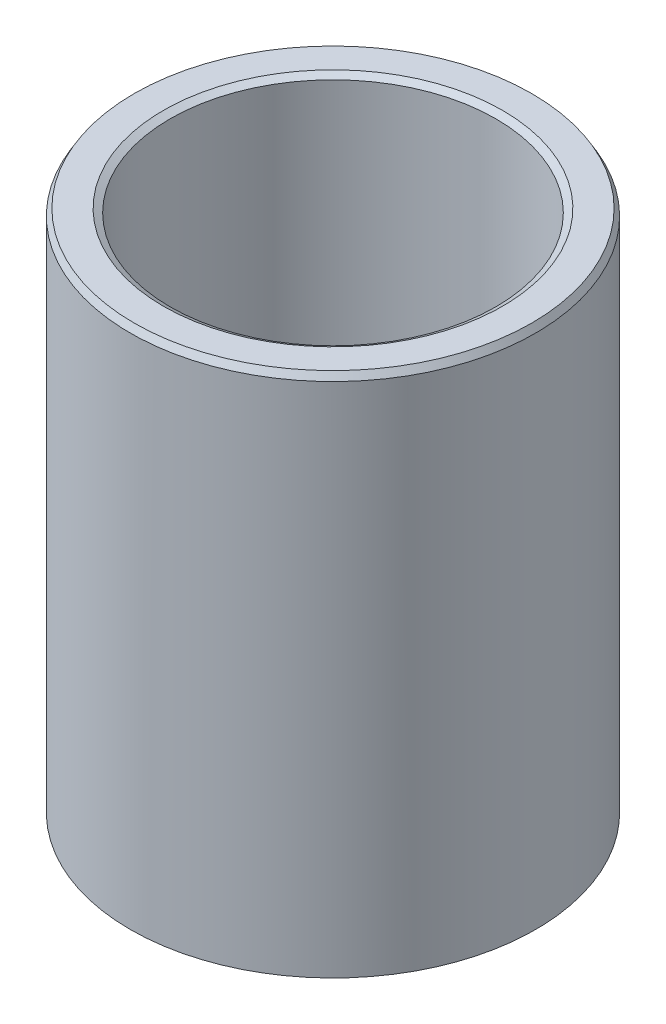
ISO-10303-21;
HEADER;
FILE_DESCRIPTION(('STEP AP214'),'2;1');
FILE_NAME('part.step','',(''),(''),'','','');
FILE_SCHEMA(('AUTOMOTIVE_DESIGN { 1 0 10303 214 1 1 1 1 }'));
ENDSEC;
DATA;
#1=APPLICATION_CONTEXT('core data for automotive mechanical design processes');
#2=APPLICATION_PROTOCOL_DEFINITION('international standard','automotive_design',2000,#1);
#3=PRODUCT_CONTEXT('',#1,'mechanical');
#4=PRODUCT('Part','Part','',(#3));
#5=PRODUCT_RELATED_PRODUCT_CATEGORY('part','',(#4));
#6=PRODUCT_DEFINITION_FORMATION('','',#4);
#7=PRODUCT_DEFINITION_CONTEXT('part definition',#1,'design');
#8=PRODUCT_DEFINITION('design','',#6,#7);
#9=PRODUCT_DEFINITION_SHAPE('','',#8);
#10=(LENGTH_UNIT() NAMED_UNIT(*) SI_UNIT(.MILLI.,.METRE.));
#11=(NAMED_UNIT(*) PLANE_ANGLE_UNIT() SI_UNIT($,.RADIAN.));
#12=(NAMED_UNIT(*) SI_UNIT($,.STERADIAN.) SOLID_ANGLE_UNIT());
#13=UNCERTAINTY_MEASURE_WITH_UNIT(LENGTH_MEASURE(1.E-05),#10,'distance_accuracy_value','');
#14=(GEOMETRIC_REPRESENTATION_CONTEXT(3) GLOBAL_UNCERTAINTY_ASSIGNED_CONTEXT((#13)) GLOBAL_UNIT_ASSIGNED_CONTEXT((#10,
#11,#12)) REPRESENTATION_CONTEXT('',''));
#15=CARTESIAN_POINT('',(0.,0.,0.));
#16=DIRECTION('',(0.,0.,1.));
#17=DIRECTION('',(1.,0.,0.));
#18=AXIS2_PLACEMENT_3D('',#15,#16,#17);
#19=CARTESIAN_POINT('',(0.,156.056264527766,0.));
#20=DIRECTION('',(0.,-1.,0.));
#21=DIRECTION('',(0.,0.,-1.));
#22=AXIS2_PLACEMENT_3D('',#19,#20,#21);
#23=CYLINDRICAL_SURFACE('',#22,60.);
#24=CARTESIAN_POINT('',(0.,1.15236053899831,0.));
#25=DIRECTION('',(0.,1.,0.));
#26=DIRECTION('',(0.,0.,1.));
#27=AXIS2_PLACEMENT_3D('',#24,#25,#26);
#28=CIRCLE('',#27,60.);
#29=CARTESIAN_POINT('',(0.,1.15236053899828,-60.));
#30=VERTEX_POINT('',#29);
#31=EDGE_CURVE('E10',#30,#30,#28,.T.);
#32=CARTESIAN_POINT('',(0.,154.060317525583,0.));
#33=DIRECTION('',(0.,1.,0.));
#34=DIRECTION('',(0.,0.,1.));
#35=AXIS2_PLACEMENT_3D('',#32,#33,#34);
#36=CIRCLE('',#35,60.);
#37=CARTESIAN_POINT('',(0.,154.060317525583,-60.));
#38=VERTEX_POINT('',#37);
#39=EDGE_CURVE('E50',#38,#38,#36,.F.);
#40=CARTESIAN_POINT('',(0.,1.15236053899828,-60.));
#41=CARTESIAN_POINT('',(0.,2.74515175760854,-60.));
#42=CARTESIAN_POINT('',(0.,4.3379429762188,-60.));
#43=CARTESIAN_POINT('',(0.,7.52352541343932,-60.));
#44=CARTESIAN_POINT('',(0.,9.11631663204958,-60.));
#45=CARTESIAN_POINT('',(0.,12.3018990692701,-60.));
#46=CARTESIAN_POINT('',(0.,13.8946902878804,-60.));
#47=CARTESIAN_POINT('',(0.,17.0802727251009,-60.));
#48=CARTESIAN_POINT('',(0.,18.6730639437111,-60.));
#49=CARTESIAN_POINT('',(0.,21.8586463809317,-60.));
#50=CARTESIAN_POINT('',(0.,23.4514375995419,-60.));
#51=CARTESIAN_POINT('',(0.,26.6370200367625,-60.));
#52=CARTESIAN_POINT('',(0.,28.2298112553727,-60.));
#53=CARTESIAN_POINT('',(0.,31.4153936925933,-60.));
#54=CARTESIAN_POINT('',(0.,33.0081849112035,-60.));
#55=CARTESIAN_POINT('',(0.,36.193767348424,-60.));
#56=CARTESIAN_POINT('',(0.,37.7865585670343,-60.));
#57=CARTESIAN_POINT('',(0.,40.9721410042548,-60.));
#58=CARTESIAN_POINT('',(0.,42.5649322228651,-60.));
#59=CARTESIAN_POINT('',(0.,45.7505146600856,-60.));
#60=CARTESIAN_POINT('',(0.,47.3433058786958,-60.));
#61=CARTESIAN_POINT('',(0.,50.5288883159164,-60.));
#62=CARTESIAN_POINT('',(0.,52.1216795345266,-60.));
#63=CARTESIAN_POINT('',(0.,55.3072619717472,-60.));
#64=CARTESIAN_POINT('',(0.,56.9000531903574,-60.));
#65=CARTESIAN_POINT('',(0.,60.0856356275779,-60.));
#66=CARTESIAN_POINT('',(0.,61.6784268461882,-60.));
#67=CARTESIAN_POINT('',(0.,64.8640092834087,-60.));
#68=CARTESIAN_POINT('',(0.,66.456800502019,-60.));
#69=CARTESIAN_POINT('',(0.,69.6423829392395,-60.));
#70=CARTESIAN_POINT('',(0.,71.2351741578498,-60.));
#71=CARTESIAN_POINT('',(0.,74.4207565950703,-60.));
#72=CARTESIAN_POINT('',(0.,76.0135478136806,-60.));
#73=CARTESIAN_POINT('',(0.,79.1991302509011,-60.));
#74=CARTESIAN_POINT('',(0.,80.7919214695113,-60.));
#75=CARTESIAN_POINT('',(0.,83.9775039067319,-60.));
#76=CARTESIAN_POINT('',(0.,85.5702951253421,-60.));
#77=CARTESIAN_POINT('',(0.,88.7558775625626,-60.));
#78=CARTESIAN_POINT('',(0.,90.3486687811729,-60.));
#79=CARTESIAN_POINT('',(0.,93.5342512183934,-60.));
#80=CARTESIAN_POINT('',(0.,95.1270424370037,-60.));
#81=CARTESIAN_POINT('',(0.,98.3126248742242,-60.));
#82=CARTESIAN_POINT('',(0.,99.9054160928345,-60.));
#83=CARTESIAN_POINT('',(0.,103.090998530055,-60.));
#84=CARTESIAN_POINT('',(0.,104.683789748665,-60.));
#85=CARTESIAN_POINT('',(0.,107.869372185886,-60.));
#86=CARTESIAN_POINT('',(0.,109.462163404496,-60.));
#87=CARTESIAN_POINT('',(0.,112.647745841717,-60.));
#88=CARTESIAN_POINT('',(0.,114.240537060327,-60.));
#89=CARTESIAN_POINT('',(0.,117.426119497547,-60.));
#90=CARTESIAN_POINT('',(0.,119.018910716158,-60.));
#91=CARTESIAN_POINT('',(0.,122.204493153378,-60.));
#92=CARTESIAN_POINT('',(0.,123.797284371988,-60.));
#93=CARTESIAN_POINT('',(0.,126.982866809209,-60.));
#94=CARTESIAN_POINT('',(0.,128.575658027819,-60.));
#95=CARTESIAN_POINT('',(0.,131.76124046504,-60.));
#96=CARTESIAN_POINT('',(0.,133.35403168365,-60.));
#97=CARTESIAN_POINT('',(0.,136.53961412087,-60.));
#98=CARTESIAN_POINT('',(0.,138.132405339481,-60.));
#99=CARTESIAN_POINT('',(0.,141.317987776701,-60.));
#100=CARTESIAN_POINT('',(0.,142.910778995312,-60.));
#101=CARTESIAN_POINT('',(0.,146.096361432532,-60.));
#102=CARTESIAN_POINT('',(0.,147.689152651142,-60.));
#103=CARTESIAN_POINT('',(0.,150.874735088363,-60.));
#104=CARTESIAN_POINT('',(0.,152.467526306973,-60.));
#105=CARTESIAN_POINT('',(0.,154.060317525583,-60.));
#106=B_SPLINE_CURVE_WITH_KNOTS('',3,(#40,#41,#42,#43,#44,#45,#46,#47,#48,#49,#50,#51,#52,#53,
#54,#55,#56,#57,#58,#59,#60,#61,#62,#63,#64,#65,#66,#67,#68,#69,#70,#71,#72,#73,#74,#75,#76,#77,
#78,#79,#80,#81,#82,#83,#84,#85,#86,#87,#88,#89,#90,#91,#92,#93,#94,#95,#96,#97,#98,#99,#100,
#101,#102,#103,#104,#105),.UNSPECIFIED.,.F.,.F.,(4,2,2,2,2,2,2,2,2,2,2,2,2,2,2,2,2,2,2,2,2,2,2,
2,2,2,2,2,2,2,2,2,4),(0.,4.77837365583078,9.55674731166156,14.3351209674923,19.1134946233231,
23.8918682791539,28.6702419349847,33.4486155908155,38.2269892466463,43.005362902477,
47.7837365583078,52.5621102141386,57.3404838699694,62.1188575258002,66.897231181631,
71.6756048374618,76.4539784932925,81.2323521491233,86.0107258049541,90.7890994607849,
95.5674731166157,100.345846772446,105.124220428277,109.902594084108,114.680967739939,
119.45934139577,124.2377150516,129.016088707431,133.794462363262,138.572836019093,
143.351209674924,148.129583330754,152.907956986585),.UNSPECIFIED.);
#107=EDGE_CURVE('BSEAM39',#30,#38,#106,.T.);
#108=ORIENTED_EDGE('',*,*,#31,.T.);
#109=ORIENTED_EDGE('',*,*,#39,.T.);
#110=ORIENTED_EDGE('',*,*,#107,.T.);
#111=ORIENTED_EDGE('',*,*,#107,.F.);
#112=EDGE_LOOP('',(#108,#110,#109,#111));
#113=FACE_BOUND('',#112,.T.);
#114=ADVANCED_FACE('F39',(#113),#23,.T.);
#115=CARTESIAN_POINT('',(0.,156.056264527766,0.));
#116=DIRECTION('',(0.,1.,0.));
#117=DIRECTION('',(0.,0.,1.));
#118=AXIS2_PLACEMENT_3D('',#115,#116,#117);
#119=PLANE('',#118);
#120=CARTESIAN_POINT('',(0.,156.056264527766,0.));
#121=DIRECTION('',(0.,1.,0.));
#122=DIRECTION('',(0.,0.,1.));
#123=AXIS2_PLACEMENT_3D('',#120,#121,#122);
#124=CIRCLE('',#123,50.2173184157135);
#125=CARTESIAN_POINT('',(0.,156.056264527766,50.2173184157135));
#126=VERTEX_POINT('',#125);
#127=EDGE_CURVE('E58',#126,#126,#124,.F.);
#128=ORIENTED_EDGE('',*,*,#127,.T.);
#129=EDGE_LOOP('',(#128));
#130=FACE_BOUND('',#129,.T.);
#131=CARTESIAN_POINT('',(0.,156.056264527766,0.));
#132=DIRECTION('',(0.,1.,0.));
#133=DIRECTION('',(0.,0.,1.));
#134=AXIS2_PLACEMENT_3D('',#131,#132,#133);
#135=CIRCLE('',#134,58.8476394610018);
#136=CARTESIAN_POINT('',(0.,156.056264527766,58.8476394610018));
#137=VERTEX_POINT('',#136);
#138=EDGE_CURVE('E61',#137,#137,#135,.T.);
#139=ORIENTED_EDGE('',*,*,#138,.T.);
#140=EDGE_LOOP('',(#139));
#141=FACE_BOUND('',#140,.T.);
#142=ADVANCED_FACE('F88',(#130,#141),#119,.T.);
#143=CARTESIAN_POINT('',(0.,0.,0.));
#144=DIRECTION('',(0.,1.,0.));
#145=DIRECTION('',(0.,0.,1.));
#146=AXIS2_PLACEMENT_3D('',#143,#144,#145);
#147=PLANE('',#146);
#148=CARTESIAN_POINT('',(0.,0.,0.));
#149=DIRECTION('',(0.,1.,0.));
#150=DIRECTION('',(0.,0.,1.));
#151=AXIS2_PLACEMENT_3D('',#148,#149,#150);
#152=CIRCLE('',#151,49.3737319525292);
#153=CARTESIAN_POINT('',(0.,0.,49.3737319525292));
#154=VERTEX_POINT('',#153);
#155=EDGE_CURVE('E51',#154,#154,#152,.T.);
#156=ORIENTED_EDGE('',*,*,#155,.T.);
#157=EDGE_LOOP('',(#156));
#158=FACE_BOUND('',#157,.T.);
#159=CARTESIAN_POINT('',(0.,0.,0.));
#160=DIRECTION('',(0.,1.,0.));
#161=DIRECTION('',(0.,0.,1.));
#162=AXIS2_PLACEMENT_3D('',#159,#160,#161);
#163=CIRCLE('',#162,58.0040529978174);
#164=CARTESIAN_POINT('',(0.,0.,58.0040529978174));
#165=VERTEX_POINT('',#164);
#166=EDGE_CURVE('E54',#165,#165,#163,.F.);
#167=ORIENTED_EDGE('',*,*,#166,.T.);
#168=EDGE_LOOP('',(#167));
#169=FACE_BOUND('',#168,.T.);
#170=ADVANCED_FACE('F83',(#158,#169),#147,.F.);
#171=CARTESIAN_POINT('',(0.,156.056264527766,0.));
#172=DIRECTION('',(0.,-1.,0.));
#173=DIRECTION('',(0.,0.,-1.));
#174=AXIS2_PLACEMENT_3D('',#171,#172,#173);
#175=CYLINDRICAL_SURFACE('',#174,48.221371413531);
#176=CARTESIAN_POINT('',(0.,154.903903988767,0.));
#177=DIRECTION('',(0.,1.,0.));
#178=DIRECTION('',(0.,0.,1.));
#179=AXIS2_PLACEMENT_3D('',#176,#177,#178);
#180=CIRCLE('',#179,48.221371413531);
#181=CARTESIAN_POINT('',(0.,154.903903988767,-48.221371413531));
#182=VERTEX_POINT('',#181);
#183=EDGE_CURVE('E67',#182,#182,#180,.T.);
#184=CARTESIAN_POINT('',(0.,1.99594700218242,0.));
#185=DIRECTION('',(0.,1.,0.));
#186=DIRECTION('',(0.,0.,1.));
#187=AXIS2_PLACEMENT_3D('',#184,#185,#186);
#188=CIRCLE('',#187,48.221371413531);
#189=CARTESIAN_POINT('',(0.,1.99594700218239,-48.221371413531));
#190=VERTEX_POINT('',#189);
#191=EDGE_CURVE('E69',#190,#190,#188,.F.);
#192=CARTESIAN_POINT('',(0.,154.903903988767,-48.221371413531));
#193=CARTESIAN_POINT('',(0.,153.311112770157,-48.221371413531));
#194=CARTESIAN_POINT('',(0.,151.718321551547,-48.221371413531));
#195=CARTESIAN_POINT('',(0.,148.532739114326,-48.221371413531));
#196=CARTESIAN_POINT('',(0.,146.939947895716,-48.221371413531));
#197=CARTESIAN_POINT('',(0.,143.754365458496,-48.221371413531));
#198=CARTESIAN_POINT('',(0.,142.161574239885,-48.221371413531));
#199=CARTESIAN_POINT('',(0.,138.975991802665,-48.221371413531));
#200=CARTESIAN_POINT('',(0.,137.383200584055,-48.221371413531));
#201=CARTESIAN_POINT('',(0.,134.197618146834,-48.221371413531));
#202=CARTESIAN_POINT('',(0.,132.604826928224,-48.221371413531));
#203=CARTESIAN_POINT('',(0.,129.419244491003,-48.221371413531));
#204=CARTESIAN_POINT('',(0.,127.826453272393,-48.221371413531));
#205=CARTESIAN_POINT('',(0.,124.640870835172,-48.221371413531));
#206=CARTESIAN_POINT('',(0.,123.048079616562,-48.221371413531));
#207=CARTESIAN_POINT('',(0.,119.862497179342,-48.221371413531));
#208=CARTESIAN_POINT('',(0.,118.269705960731,-48.221371413531));
#209=CARTESIAN_POINT('',(0.,115.084123523511,-48.221371413531));
#210=CARTESIAN_POINT('',(0.,113.491332304901,-48.221371413531));
#211=CARTESIAN_POINT('',(0.,110.30574986768,-48.221371413531));
#212=CARTESIAN_POINT('',(0.,108.71295864907,-48.221371413531));
#213=CARTESIAN_POINT('',(0.,105.527376211849,-48.221371413531));
#214=CARTESIAN_POINT('',(0.,103.934584993239,-48.221371413531));
#215=CARTESIAN_POINT('',(0.,100.749002556019,-48.221371413531));
#216=CARTESIAN_POINT('',(0.,99.1562113374083,-48.221371413531));
#217=CARTESIAN_POINT('',(0.,95.9706289001878,-48.221371413531));
#218=CARTESIAN_POINT('',(0.,94.3778376815775,-48.221371413531));
#219=CARTESIAN_POINT('',(0.,91.192255244357,-48.221371413531));
#220=CARTESIAN_POINT('',(0.,89.5994640257467,-48.221371413531));
#221=CARTESIAN_POINT('',(0.,86.4138815885262,-48.221371413531));
#222=CARTESIAN_POINT('',(0.,84.821090369916,-48.221371413531));
#223=CARTESIAN_POINT('',(0.,81.6355079326954,-48.221371413531));
#224=CARTESIAN_POINT('',(0.,80.0427167140852,-48.221371413531));
#225=CARTESIAN_POINT('',(0.,76.8571342768646,-48.221371413531));
#226=CARTESIAN_POINT('',(0.,75.2643430582544,-48.221371413531));
#227=CARTESIAN_POINT('',(0.,72.0787606210339,-48.221371413531));
#228=CARTESIAN_POINT('',(0.,70.4859694024236,-48.221371413531));
#229=CARTESIAN_POINT('',(0.,67.3003869652031,-48.221371413531));
#230=CARTESIAN_POINT('',(0.,65.7075957465928,-48.221371413531));
#231=CARTESIAN_POINT('',(0.,62.5220133093723,-48.221371413531));
#232=CARTESIAN_POINT('',(0.,60.929222090762,-48.221371413531));
#233=CARTESIAN_POINT('',(0.,57.7436396535415,-48.221371413531));
#234=CARTESIAN_POINT('',(0.,56.1508484349313,-48.221371413531));
#235=CARTESIAN_POINT('',(0.,52.9652659977107,-48.221371413531));
#236=CARTESIAN_POINT('',(0.,51.3724747791005,-48.221371413531));
#237=CARTESIAN_POINT('',(0.,48.18689234188,-48.221371413531));
#238=CARTESIAN_POINT('',(0.,46.5941011232697,-48.221371413531));
#239=CARTESIAN_POINT('',(0.,43.4085186860492,-48.221371413531));
#240=CARTESIAN_POINT('',(0.,41.8157274674389,-48.221371413531));
#241=CARTESIAN_POINT('',(0.,38.6301450302184,-48.221371413531));
#242=CARTESIAN_POINT('',(0.,37.0373538116081,-48.221371413531));
#243=CARTESIAN_POINT('',(0.,33.8517713743876,-48.221371413531));
#244=CARTESIAN_POINT('',(0.,32.2589801557773,-48.221371413531));
#245=CARTESIAN_POINT('',(0.,29.0733977185568,-48.221371413531));
#246=CARTESIAN_POINT('',(0.,27.4806064999466,-48.221371413531));
#247=CARTESIAN_POINT('',(0.,24.295024062726,-48.221371413531));
#248=CARTESIAN_POINT('',(0.,22.7022328441158,-48.221371413531));
#249=CARTESIAN_POINT('',(0.,19.5166504068953,-48.221371413531));
#250=CARTESIAN_POINT('',(0.,17.923859188285,-48.221371413531));
#251=CARTESIAN_POINT('',(0.,14.7382767510645,-48.221371413531));
#252=CARTESIAN_POINT('',(0.,13.1454855324542,-48.221371413531));
#253=CARTESIAN_POINT('',(0.,9.95990309523369,-48.221371413531));
#254=CARTESIAN_POINT('',(0.,8.36711187662343,-48.221371413531));
#255=CARTESIAN_POINT('',(0.,5.18152943940291,-48.221371413531));
#256=CARTESIAN_POINT('',(0.,3.58873822079265,-48.221371413531));
#257=CARTESIAN_POINT('',(0.,1.99594700218239,-48.221371413531));
#258=B_SPLINE_CURVE_WITH_KNOTS('',3,(#192,#193,#194,#195,#196,#197,#198,#199,#200,#201,#202,
#203,#204,#205,#206,#207,#208,#209,#210,#211,#212,#213,#214,#215,#216,#217,#218,#219,#220,#221,
#222,#223,#224,#225,#226,#227,#228,#229,#230,#231,#232,#233,#234,#235,#236,#237,#238,#239,#240,
#241,#242,#243,#244,#245,#246,#247,#248,#249,#250,#251,#252,#253,#254,#255,#256,#257),
.UNSPECIFIED.,.F.,.F.,(4,2,2,2,2,2,2,2,2,2,2,2,2,2,2,2,2,2,2,2,2,2,2,2,2,2,2,2,2,2,2,2,4),(0.,
4.77837365583078,9.55674731166153,14.3351209674923,19.1134946233231,23.8918682791539,
28.6702419349847,33.4486155908155,38.2269892466462,43.005362902477,47.7837365583078,
52.5621102141386,57.3404838699694,62.1188575258001,66.8972311816309,71.6756048374617,
76.4539784932925,81.2323521491233,86.010725804954,90.7890994607848,95.5674731166156,
100.345846772446,105.124220428277,109.902594084108,114.680967739939,119.45934139577,
124.2377150516,129.016088707431,133.794462363262,138.572836019093,143.351209674923,
148.129583330754,152.907956986585),.UNSPECIFIED.);
#259=EDGE_CURVE('BSEAM71',#182,#190,#258,.T.);
#260=ORIENTED_EDGE('',*,*,#183,.T.);
#261=ORIENTED_EDGE('',*,*,#191,.T.);
#262=ORIENTED_EDGE('',*,*,#259,.T.);
#263=ORIENTED_EDGE('',*,*,#259,.F.);
#264=EDGE_LOOP('',(#260,#262,#261,#263));
#265=FACE_BOUND('',#264,.T.);
#266=ADVANCED_FACE('F71',(#265),#175,.F.);
#267=CARTESIAN_POINT('',(0.,154.903903988767,0.));
#268=DIRECTION('',(0.,1.,0.));
#269=DIRECTION('',(0.,0.,1.));
#270=AXIS2_PLACEMENT_3D('',#267,#268,#269);
#271=CONICAL_SURFACE('',#270,48.221371413531,1.0471975511966);
#272=ORIENTED_EDGE('',*,*,#127,.F.);
#273=EDGE_LOOP('',(#272));
#274=FACE_BOUND('',#273,.T.);
#275=ORIENTED_EDGE('',*,*,#183,.F.);
#276=EDGE_LOOP('',(#275));
#277=FACE_BOUND('',#276,.T.);
#278=ADVANCED_FACE('F77',(#274,#277),#271,.F.);
#279=CARTESIAN_POINT('',(0.,0.,0.));
#280=DIRECTION('',(0.,-1.,0.));
#281=DIRECTION('',(0.,0.,-1.));
#282=AXIS2_PLACEMENT_3D('',#279,#280,#281);
#283=CONICAL_SURFACE('',#282,49.3737319525292,0.523598775598302);
#284=ORIENTED_EDGE('',*,*,#191,.F.);
#285=EDGE_LOOP('',(#284));
#286=FACE_BOUND('',#285,.T.);
#287=ORIENTED_EDGE('',*,*,#155,.F.);
#288=EDGE_LOOP('',(#287));
#289=FACE_BOUND('',#288,.T.);
#290=ADVANCED_FACE('F73',(#286,#289),#283,.F.);
#291=CARTESIAN_POINT('',(0.,1.15236053899831,0.));
#292=DIRECTION('',(0.,1.,0.));
#293=DIRECTION('',(0.,0.,1.));
#294=AXIS2_PLACEMENT_3D('',#291,#292,#293);
#295=CONICAL_SURFACE('',#294,60.,1.04719755119661);
#296=ORIENTED_EDGE('',*,*,#166,.F.);
#297=EDGE_LOOP('',(#296));
#298=FACE_BOUND('',#297,.T.);
#299=ORIENTED_EDGE('',*,*,#31,.F.);
#300=EDGE_LOOP('',(#299));
#301=FACE_BOUND('',#300,.T.);
#302=ADVANCED_FACE('F76',(#298,#301),#295,.T.);
#303=CARTESIAN_POINT('',(0.,156.056264527766,0.));
#304=DIRECTION('',(0.,-1.,0.));
#305=DIRECTION('',(0.,0.,-1.));
#306=AXIS2_PLACEMENT_3D('',#303,#304,#305);
#307=CONICAL_SURFACE('',#306,58.8476394610018,0.523598775598307);
#308=ORIENTED_EDGE('',*,*,#39,.F.);
#309=EDGE_LOOP('',(#308));
#310=FACE_BOUND('',#309,.T.);
#311=ORIENTED_EDGE('',*,*,#138,.F.);
#312=EDGE_LOOP('',(#311));
#313=FACE_BOUND('',#312,.T.);
#314=ADVANCED_FACE('F45',(#310,#313),#307,.T.);
#315=CLOSED_SHELL('',(#114,#142,#170,#266,#278,#290,#302,#314));
#316=MANIFOLD_SOLID_BREP('B2',#315);
#317=ADVANCED_BREP_SHAPE_REPRESENTATION('',(#18,#316),#14);
#318=SHAPE_DEFINITION_REPRESENTATION(#9,#317);
ENDSEC;
END-ISO-10303-21;
